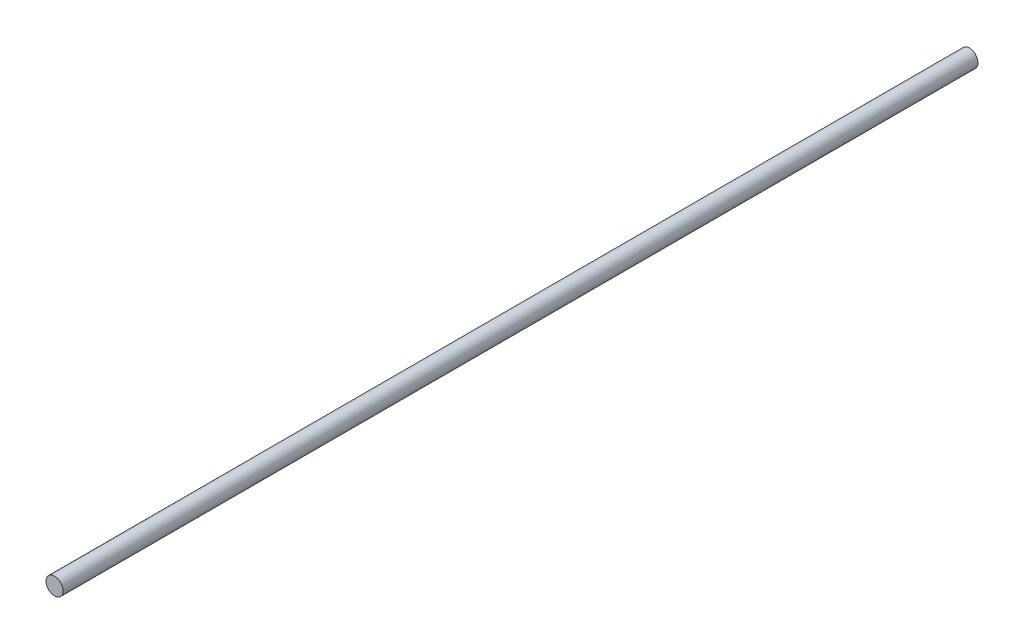
ISO-10303-21;
HEADER;
FILE_DESCRIPTION(('STEP AP214'),'2;1');
FILE_NAME('part.step','',(''),(''),'','','');
FILE_SCHEMA(('AUTOMOTIVE_DESIGN { 1 0 10303 214 1 1 1 1 }'));
ENDSEC;
DATA;
#1=APPLICATION_CONTEXT('core data for automotive mechanical design processes');
#2=APPLICATION_PROTOCOL_DEFINITION('international standard','automotive_design',2000,#1);
#3=PRODUCT_CONTEXT('',#1,'mechanical');
#4=PRODUCT('Part','Part','',(#3));
#5=PRODUCT_RELATED_PRODUCT_CATEGORY('part','',(#4));
#6=PRODUCT_DEFINITION_FORMATION('','',#4);
#7=PRODUCT_DEFINITION_CONTEXT('part definition',#1,'design');
#8=PRODUCT_DEFINITION('design','',#6,#7);
#9=PRODUCT_DEFINITION_SHAPE('','',#8);
#10=(LENGTH_UNIT() NAMED_UNIT(*) SI_UNIT(.MILLI.,.METRE.));
#11=(NAMED_UNIT(*) PLANE_ANGLE_UNIT() SI_UNIT($,.RADIAN.));
#12=(NAMED_UNIT(*) SI_UNIT($,.STERADIAN.) SOLID_ANGLE_UNIT());
#13=UNCERTAINTY_MEASURE_WITH_UNIT(LENGTH_MEASURE(1.E-05),#10,'distance_accuracy_value','');
#14=(GEOMETRIC_REPRESENTATION_CONTEXT(3) GLOBAL_UNCERTAINTY_ASSIGNED_CONTEXT((#13)) GLOBAL_UNIT_ASSIGNED_CONTEXT((#10,
#11,#12)) REPRESENTATION_CONTEXT('',''));
#15=CARTESIAN_POINT('',(0.,0.,0.));
#16=DIRECTION('',(0.,0.,1.));
#17=DIRECTION('',(1.,0.,0.));
#18=AXIS2_PLACEMENT_3D('',#15,#16,#17);
#19=CARTESIAN_POINT('',(0.,0.,254.));
#20=DIRECTION('',(0.,0.,-1.));
#21=DIRECTION('',(-1.,0.,0.));
#22=AXIS2_PLACEMENT_3D('',#19,#20,#21);
#23=CYLINDRICAL_SURFACE('',#22,4.765);
#24=CARTESIAN_POINT('',(0.,0.,254.));
#25=DIRECTION('',(0.,0.,1.));
#26=DIRECTION('',(1.,0.,0.));
#27=AXIS2_PLACEMENT_3D('',#24,#25,#26);
#28=CIRCLE('',#27,4.765);
#29=CARTESIAN_POINT('',(4.765,0.,254.));
#30=VERTEX_POINT('',#29);
#31=EDGE_CURVE('E10',#30,#30,#28,.T.);
#32=ORIENTED_EDGE('',*,*,#31,.F.);
#33=EDGE_LOOP('',(#32));
#34=FACE_BOUND('',#33,.T.);
#35=CARTESIAN_POINT('',(0.,0.,-254.));
#36=DIRECTION('',(0.,0.,1.));
#37=DIRECTION('',(1.,0.,0.));
#38=AXIS2_PLACEMENT_3D('',#35,#36,#37);
#39=CIRCLE('',#38,4.765);
#40=CARTESIAN_POINT('',(4.765,0.,-254.));
#41=VERTEX_POINT('',#40);
#42=EDGE_CURVE('E38',#41,#41,#39,.T.);
#43=ORIENTED_EDGE('',*,*,#42,.T.);
#44=EDGE_LOOP('',(#43));
#45=FACE_BOUND('',#44,.T.);
#46=ADVANCED_FACE('F35',(#34,#45),#23,.T.);
#47=CARTESIAN_POINT('',(0.,0.,254.));
#48=DIRECTION('',(0.,0.,1.));
#49=DIRECTION('',(1.,0.,0.));
#50=AXIS2_PLACEMENT_3D('',#47,#48,#49);
#51=PLANE('',#50);
#52=ORIENTED_EDGE('',*,*,#31,.T.);
#53=EDGE_LOOP('',(#52));
#54=FACE_BOUND('',#53,.T.);
#55=ADVANCED_FACE('F50',(#54),#51,.T.);
#56=CARTESIAN_POINT('',(0.,0.,-254.));
#57=DIRECTION('',(0.,0.,1.));
#58=DIRECTION('',(1.,0.,0.));
#59=AXIS2_PLACEMENT_3D('',#56,#57,#58);
#60=PLANE('',#59);
#61=ORIENTED_EDGE('',*,*,#42,.F.);
#62=EDGE_LOOP('',(#61));
#63=FACE_BOUND('',#62,.T.);
#64=ADVANCED_FACE('F48',(#63),#60,.F.);
#65=CLOSED_SHELL('',(#46,#55,#64));
#66=MANIFOLD_SOLID_BREP('B2',#65);
#67=ADVANCED_BREP_SHAPE_REPRESENTATION('',(#18,#66),#14);
#68=SHAPE_DEFINITION_REPRESENTATION(#9,#67);
ENDSEC;
END-ISO-10303-21;
